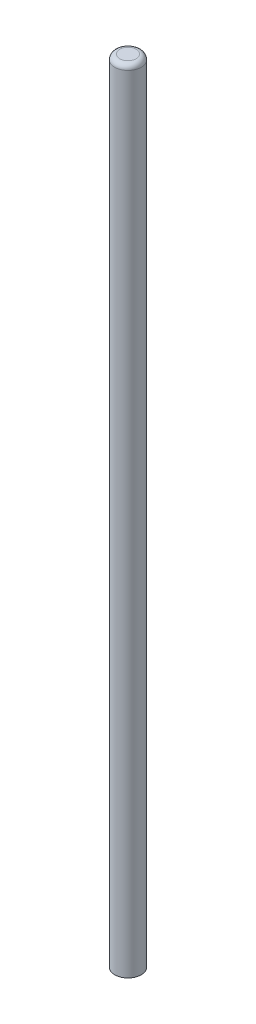
ISO-10303-21;
HEADER;
FILE_DESCRIPTION(('STEP AP214'),'2;1');
FILE_NAME('part.step','',(''),(''),'','','');
FILE_SCHEMA(('AUTOMOTIVE_DESIGN { 1 0 10303 214 1 1 1 1 }'));
ENDSEC;
DATA;
#1=APPLICATION_CONTEXT('core data for automotive mechanical design processes');
#2=APPLICATION_PROTOCOL_DEFINITION('international standard','automotive_design',2000,#1);
#3=PRODUCT_CONTEXT('',#1,'mechanical');
#4=PRODUCT('Part','Part','',(#3));
#5=PRODUCT_RELATED_PRODUCT_CATEGORY('part','',(#4));
#6=PRODUCT_DEFINITION_FORMATION('','',#4);
#7=PRODUCT_DEFINITION_CONTEXT('part definition',#1,'design');
#8=PRODUCT_DEFINITION('design','',#6,#7);
#9=PRODUCT_DEFINITION_SHAPE('','',#8);
#10=(LENGTH_UNIT() NAMED_UNIT(*) SI_UNIT(.MILLI.,.METRE.));
#11=(NAMED_UNIT(*) PLANE_ANGLE_UNIT() SI_UNIT($,.RADIAN.));
#12=(NAMED_UNIT(*) SI_UNIT($,.STERADIAN.) SOLID_ANGLE_UNIT());
#13=UNCERTAINTY_MEASURE_WITH_UNIT(LENGTH_MEASURE(1.E-05),#10,'distance_accuracy_value','');
#14=(GEOMETRIC_REPRESENTATION_CONTEXT(3) GLOBAL_UNCERTAINTY_ASSIGNED_CONTEXT((#13)) GLOBAL_UNIT_ASSIGNED_CONTEXT((#10,
#11,#12)) REPRESENTATION_CONTEXT('',''));
#15=CARTESIAN_POINT('',(0.,0.,0.));
#16=DIRECTION('',(0.,0.,1.));
#17=DIRECTION('',(1.,0.,0.));
#18=AXIS2_PLACEMENT_3D('',#15,#16,#17);
#19=CARTESIAN_POINT('',(0.,120.,0.));
#20=DIRECTION('',(0.,-1.,0.));
#21=DIRECTION('',(0.,0.,-1.));
#22=AXIS2_PLACEMENT_3D('',#19,#20,#21);
#23=CYLINDRICAL_SURFACE('',#22,2.);
#24=CARTESIAN_POINT('',(0.,119.25,0.));
#25=DIRECTION('',(0.,1.,0.));
#26=DIRECTION('',(0.,0.,1.));
#27=AXIS2_PLACEMENT_3D('',#24,#25,#26);
#28=CIRCLE('',#27,2.);
#29=CARTESIAN_POINT('',(0.,119.25,2.));
#30=VERTEX_POINT('',#29);
#31=EDGE_CURVE('E10',#30,#30,#28,.F.);
#32=ORIENTED_EDGE('',*,*,#31,.T.);
#33=EDGE_LOOP('',(#32));
#34=FACE_BOUND('',#33,.T.);
#35=CARTESIAN_POINT('',(0.,0.,0.));
#36=DIRECTION('',(0.,1.,0.));
#37=DIRECTION('',(0.,0.,1.));
#38=AXIS2_PLACEMENT_3D('',#35,#36,#37);
#39=CIRCLE('',#38,2.);
#40=CARTESIAN_POINT('',(0.,0.,2.));
#41=VERTEX_POINT('',#40);
#42=EDGE_CURVE('E41',#41,#41,#39,.T.);
#43=ORIENTED_EDGE('',*,*,#42,.T.);
#44=EDGE_LOOP('',(#43));
#45=FACE_BOUND('',#44,.T.);
#46=ADVANCED_FACE('F30',(#34,#45),#23,.T.);
#47=CARTESIAN_POINT('',(0.,120.,0.));
#48=DIRECTION('',(0.,1.,0.));
#49=DIRECTION('',(0.,0.,1.));
#50=AXIS2_PLACEMENT_3D('',#47,#48,#49);
#51=PLANE('',#50);
#52=CARTESIAN_POINT('',(0.,120.,0.));
#53=DIRECTION('',(0.,1.,0.));
#54=DIRECTION('',(0.,0.,1.));
#55=AXIS2_PLACEMENT_3D('',#52,#53,#54);
#56=CIRCLE('',#55,1.25);
#57=CARTESIAN_POINT('',(0.,120.,1.25));
#58=VERTEX_POINT('',#57);
#59=EDGE_CURVE('E37',#58,#58,#56,.T.);
#60=ORIENTED_EDGE('',*,*,#59,.T.);
#61=EDGE_LOOP('',(#60));
#62=FACE_BOUND('',#61,.T.);
#63=ADVANCED_FACE('F51',(#62),#51,.T.);
#64=CARTESIAN_POINT('',(0.,0.,0.));
#65=DIRECTION('',(0.,1.,0.));
#66=DIRECTION('',(0.,0.,1.));
#67=AXIS2_PLACEMENT_3D('',#64,#65,#66);
#68=PLANE('',#67);
#69=ORIENTED_EDGE('',*,*,#42,.F.);
#70=EDGE_LOOP('',(#69));
#71=FACE_BOUND('',#70,.T.);
#72=ADVANCED_FACE('F49',(#71),#68,.F.);
#73=CARTESIAN_POINT('',(0.,119.25,0.));
#74=DIRECTION('',(0.,1.,0.));
#75=DIRECTION('',(0.,0.,1.));
#76=AXIS2_PLACEMENT_3D('',#73,#74,#75);
#77=TOROIDAL_SURFACE('',#76,1.25,0.75);
#78=ORIENTED_EDGE('',*,*,#31,.F.);
#79=EDGE_LOOP('',(#78));
#80=FACE_BOUND('',#79,.T.);
#81=ORIENTED_EDGE('',*,*,#59,.F.);
#82=EDGE_LOOP('',(#81));
#83=FACE_BOUND('',#82,.T.);
#84=ADVANCED_FACE('F32',(#80,#83),#77,.T.);
#85=CLOSED_SHELL('',(#46,#63,#72,#84));
#86=MANIFOLD_SOLID_BREP('B2',#85);
#87=ADVANCED_BREP_SHAPE_REPRESENTATION('',(#18,#86),#14);
#88=SHAPE_DEFINITION_REPRESENTATION(#9,#87);
ENDSEC;
END-ISO-10303-21;
